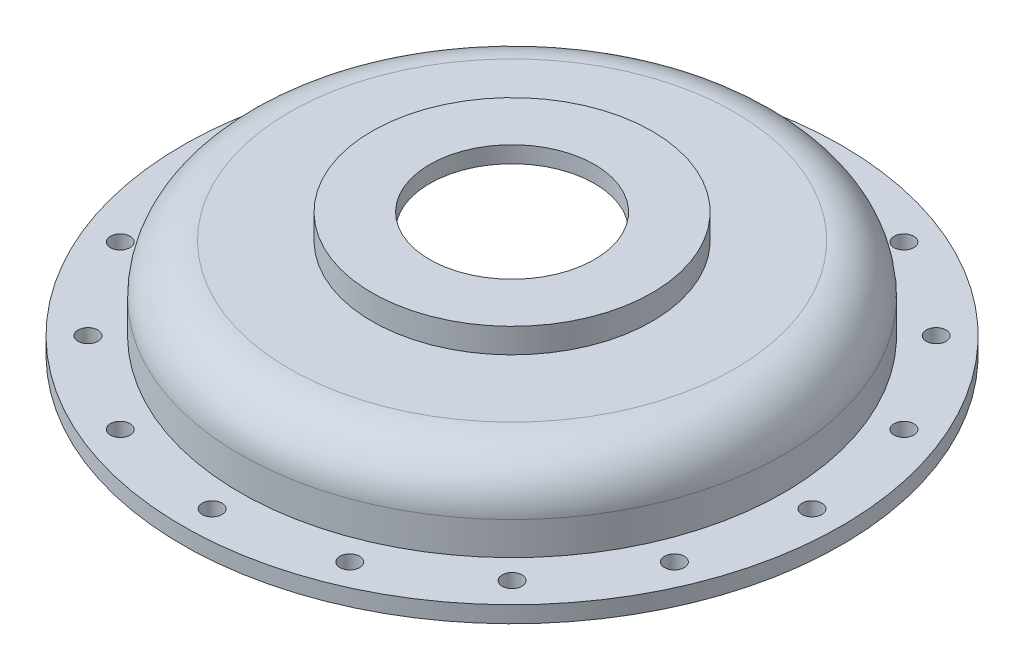
ISO-10303-21;
HEADER;
FILE_DESCRIPTION(('STEP AP214'),'2;1');
FILE_NAME('part.step','',(''),(''),'','','');
FILE_SCHEMA(('AUTOMOTIVE_DESIGN { 1 0 10303 214 1 1 1 1 }'));
ENDSEC;
DATA;
#1=APPLICATION_CONTEXT('core data for automotive mechanical design processes');
#2=APPLICATION_PROTOCOL_DEFINITION('international standard','automotive_design',2000,#1);
#3=PRODUCT_CONTEXT('',#1,'mechanical');
#4=PRODUCT('Part','Part','',(#3));
#5=PRODUCT_RELATED_PRODUCT_CATEGORY('part','',(#4));
#6=PRODUCT_DEFINITION_FORMATION('','',#4);
#7=PRODUCT_DEFINITION_CONTEXT('part definition',#1,'design');
#8=PRODUCT_DEFINITION('design','',#6,#7);
#9=PRODUCT_DEFINITION_SHAPE('','',#8);
#10=(LENGTH_UNIT() NAMED_UNIT(*) SI_UNIT(.MILLI.,.METRE.));
#11=(NAMED_UNIT(*) PLANE_ANGLE_UNIT() SI_UNIT($,.RADIAN.));
#12=(NAMED_UNIT(*) SI_UNIT($,.STERADIAN.) SOLID_ANGLE_UNIT());
#13=UNCERTAINTY_MEASURE_WITH_UNIT(LENGTH_MEASURE(1.E-05),#10,'distance_accuracy_value','');
#14=(GEOMETRIC_REPRESENTATION_CONTEXT(3) GLOBAL_UNCERTAINTY_ASSIGNED_CONTEXT((#13)) GLOBAL_UNIT_ASSIGNED_CONTEXT((#10,
#11,#12)) REPRESENTATION_CONTEXT('',''));
#15=CARTESIAN_POINT('',(0.,0.,0.));
#16=DIRECTION('',(0.,0.,1.));
#17=DIRECTION('',(1.,0.,0.));
#18=AXIS2_PLACEMENT_3D('',#15,#16,#17);
#19=CARTESIAN_POINT('',(200.,0.,0.));
#20=DIRECTION('',(0.,-1.,0.));
#21=DIRECTION('',(0.,0.,-1.));
#22=AXIS2_PLACEMENT_3D('',#19,#20,#21);
#23=PLANE('',#22);
#24=CARTESIAN_POINT('',(128.693434175951,0.,128.693434175952));
#25=DIRECTION('',(0.,1.,0.));
#26=DIRECTION('',(-0.707106781186549,0.,0.707106781186546));
#27=AXIS2_PLACEMENT_3D('',#24,#25,#26);
#28=CIRCLE('',#27,6.00000000000002);
#29=CARTESIAN_POINT('',(124.450793488832,0.,132.936074863071));
#30=VERTEX_POINT('',#29);
#31=EDGE_CURVE('E117',#30,#30,#28,.T.);
#32=ORIENTED_EDGE('',*,*,#31,.T.);
#33=EDGE_LOOP('',(#32));
#34=FACE_BOUND('',#33,.T.);
#35=CARTESIAN_POINT('',(69.6483846904459,0.,168.146074917054));
#36=DIRECTION('',(0.,1.,0.));
#37=DIRECTION('',(-0.923879532511288,0.,0.382683432365087));
#38=AXIS2_PLACEMENT_3D('',#35,#36,#37);
#39=CIRCLE('',#38,6.00000000000002);
#40=CARTESIAN_POINT('',(64.1051074953781,0.,170.442175511245));
#41=VERTEX_POINT('',#40);
#42=EDGE_CURVE('E174',#41,#41,#39,.T.);
#43=ORIENTED_EDGE('',*,*,#42,.T.);
#44=EDGE_LOOP('',(#43));
#45=FACE_BOUND('',#44,.T.);
#46=CARTESIAN_POINT('',(-6.3544960366945E-13,0.,182.));
#47=DIRECTION('',(0.,1.,0.));
#48=DIRECTION('',(-1.,0.,0.));
#49=AXIS2_PLACEMENT_3D('',#46,#47,#48);
#50=CIRCLE('',#49,6.00000000000002);
#51=CARTESIAN_POINT('',(-6.00000000000065,0.,182.));
#52=VERTEX_POINT('',#51);
#53=EDGE_CURVE('E166',#52,#52,#50,.T.);
#54=ORIENTED_EDGE('',*,*,#53,.T.);
#55=EDGE_LOOP('',(#54));
#56=FACE_BOUND('',#55,.T.);
#57=CARTESIAN_POINT('',(-69.6483846904471,0.,168.146074917054));
#58=DIRECTION('',(0.,1.,0.));
#59=DIRECTION('',(-0.923879532511285,0.,-0.382683432365094));
#60=AXIS2_PLACEMENT_3D('',#57,#58,#59);
#61=CIRCLE('',#60,6.00000000000002);
#62=CARTESIAN_POINT('',(-75.1916618855148,0.,165.849974322863));
#63=VERTEX_POINT('',#62);
#64=EDGE_CURVE('E158',#63,#63,#61,.T.);
#65=ORIENTED_EDGE('',*,*,#64,.T.);
#66=EDGE_LOOP('',(#65));
#67=FACE_BOUND('',#66,.T.);
#68=CARTESIAN_POINT('',(-128.693434175952,0.,128.693434175951));
#69=DIRECTION('',(0.,1.,0.));
#70=DIRECTION('',(-0.707106781186544,0.,-0.707106781186551));
#71=AXIS2_PLACEMENT_3D('',#68,#69,#70);
#72=CIRCLE('',#71,6.00000000000002);
#73=CARTESIAN_POINT('',(-132.936074863072,0.,124.450793488832));
#74=VERTEX_POINT('',#73);
#75=EDGE_CURVE('E150',#74,#74,#72,.T.);
#76=ORIENTED_EDGE('',*,*,#75,.T.);
#77=EDGE_LOOP('',(#76));
#78=FACE_BOUND('',#77,.T.);
#79=CARTESIAN_POINT('',(-168.146074917055,0.,69.6483846904453));
#80=DIRECTION('',(0.,1.,0.));
#81=DIRECTION('',(-0.382683432365084,0.,-0.923879532511289));
#82=AXIS2_PLACEMENT_3D('',#79,#80,#81);
#83=CIRCLE('',#82,6.00000000000002);
#84=CARTESIAN_POINT('',(-170.442175511245,0.,64.1051074953776));
#85=VERTEX_POINT('',#84);
#86=EDGE_CURVE('E142',#85,#85,#83,.T.);
#87=ORIENTED_EDGE('',*,*,#86,.T.);
#88=EDGE_LOOP('',(#87));
#89=FACE_BOUND('',#88,.T.);
#90=CARTESIAN_POINT('',(-182.,0.,0.));
#91=DIRECTION('',(0.,1.,0.));
#92=DIRECTION('',(0.,0.,-1.));
#93=AXIS2_PLACEMENT_3D('',#90,#91,#92);
#94=CIRCLE('',#93,6.00000000000002);
#95=CARTESIAN_POINT('',(-182.,0.,-6.00000000000002));
#96=VERTEX_POINT('',#95);
#97=EDGE_CURVE('E134',#96,#96,#94,.T.);
#98=ORIENTED_EDGE('',*,*,#97,.T.);
#99=EDGE_LOOP('',(#98));
#100=FACE_BOUND('',#99,.T.);
#101=CARTESIAN_POINT('',(-168.146074917054,0.,-69.6483846904477));
#102=DIRECTION('',(0.,1.,0.));
#103=DIRECTION('',(0.382683432365097,0.,-0.923879532511284));
#104=AXIS2_PLACEMENT_3D('',#101,#102,#103);
#105=CIRCLE('',#104,6.00000000000002);
#106=CARTESIAN_POINT('',(-165.849974322863,0.,-75.1916618855154));
#107=VERTEX_POINT('',#106);
#108=EDGE_CURVE('E125',#107,#107,#105,.T.);
#109=ORIENTED_EDGE('',*,*,#108,.T.);
#110=EDGE_LOOP('',(#109));
#111=FACE_BOUND('',#110,.T.);
#112=CARTESIAN_POINT('',(-128.693434175951,0.,-128.693434175953));
#113=DIRECTION('',(0.,1.,0.));
#114=DIRECTION('',(0.707106781186554,0.,-0.707106781186541));
#115=AXIS2_PLACEMENT_3D('',#112,#113,#114);
#116=CIRCLE('',#115,6.00000000000002);
#117=CARTESIAN_POINT('',(-124.450793488831,0.,-132.936074863072));
#118=VERTEX_POINT('',#117);
#119=EDGE_CURVE('E126',#118,#118,#116,.T.);
#120=ORIENTED_EDGE('',*,*,#119,.T.);
#121=EDGE_LOOP('',(#120));
#122=FACE_BOUND('',#121,.T.);
#123=CARTESIAN_POINT('',(-69.6483846904447,0.,-168.146074917055));
#124=DIRECTION('',(0.,1.,0.));
#125=DIRECTION('',(0.923879532511291,0.,-0.382683432365081));
#126=AXIS2_PLACEMENT_3D('',#123,#124,#125);
#127=CIRCLE('',#126,6.00000000000002);
#128=CARTESIAN_POINT('',(-64.1051074953769,0.,-170.442175511245));
#129=VERTEX_POINT('',#128);
#130=EDGE_CURVE('E221',#129,#129,#127,.T.);
#131=ORIENTED_EDGE('',*,*,#130,.T.);
#132=EDGE_LOOP('',(#131));
#133=FACE_BOUND('',#132,.T.);
#134=CARTESIAN_POINT('',(1.90634881100835E-12,0.,-182.));
#135=DIRECTION('',(0.,1.,0.));
#136=DIRECTION('',(1.,0.,0.));
#137=AXIS2_PLACEMENT_3D('',#134,#135,#136);
#138=CIRCLE('',#137,6.00000000000002);
#139=CARTESIAN_POINT('',(6.00000000000192,0.,-182.));
#140=VERTEX_POINT('',#139);
#141=EDGE_CURVE('E213',#140,#140,#138,.T.);
#142=ORIENTED_EDGE('',*,*,#141,.T.);
#143=EDGE_LOOP('',(#142));
#144=FACE_BOUND('',#143,.T.);
#145=CARTESIAN_POINT('',(69.6483846904482,0.,-168.146074917053));
#146=DIRECTION('',(0.,1.,0.));
#147=DIRECTION('',(0.923879532511283,0.,0.3826834323651));
#148=AXIS2_PLACEMENT_3D('',#145,#146,#147);
#149=CIRCLE('',#148,6.00000000000002);
#150=CARTESIAN_POINT('',(75.1916618855159,0.,-165.849974322863));
#151=VERTEX_POINT('',#150);
#152=EDGE_CURVE('E205',#151,#151,#149,.T.);
#153=ORIENTED_EDGE('',*,*,#152,.T.);
#154=EDGE_LOOP('',(#153));
#155=FACE_BOUND('',#154,.T.);
#156=CARTESIAN_POINT('',(128.693434175953,0.,-128.69343417595));
#157=DIRECTION('',(0.,1.,0.));
#158=DIRECTION('',(0.707106781186539,0.,0.707106781186556));
#159=AXIS2_PLACEMENT_3D('',#156,#157,#158);
#160=CIRCLE('',#159,6.00000000000002);
#161=CARTESIAN_POINT('',(132.936074863072,0.,-124.450793488831));
#162=VERTEX_POINT('',#161);
#163=EDGE_CURVE('E197',#162,#162,#160,.T.);
#164=ORIENTED_EDGE('',*,*,#163,.T.);
#165=EDGE_LOOP('',(#164));
#166=FACE_BOUND('',#165,.T.);
#167=CARTESIAN_POINT('',(168.146074917055,0.,-69.6483846904441));
#168=DIRECTION('',(0.,1.,0.));
#169=DIRECTION('',(0.382683432365077,0.,0.923879532511292));
#170=AXIS2_PLACEMENT_3D('',#167,#168,#169);
#171=CIRCLE('',#170,6.00000000000002);
#172=CARTESIAN_POINT('',(170.442175511246,0.,-64.1051074953763));
#173=VERTEX_POINT('',#172);
#174=EDGE_CURVE('E189',#173,#173,#171,.T.);
#175=ORIENTED_EDGE('',*,*,#174,.T.);
#176=EDGE_LOOP('',(#175));
#177=FACE_BOUND('',#176,.T.);
#178=CARTESIAN_POINT('',(168.146074917054,0.,69.6483846904465));
#179=DIRECTION('',(0.,1.,0.));
#180=DIRECTION('',(-0.382683432365091,0.,0.923879532511287));
#181=AXIS2_PLACEMENT_3D('',#178,#179,#180);
#182=CIRCLE('',#181,6.00000000000002);
#183=CARTESIAN_POINT('',(165.849974322864,0.,75.1916618855142));
#184=VERTEX_POINT('',#183);
#185=EDGE_CURVE('E109',#184,#184,#182,.T.);
#186=ORIENTED_EDGE('',*,*,#185,.T.);
#187=EDGE_LOOP('',(#186));
#188=FACE_BOUND('',#187,.T.);
#189=CARTESIAN_POINT('',(182.,0.,0.));
#190=DIRECTION('',(0.,1.,0.));
#191=DIRECTION('',(0.,0.,1.));
#192=AXIS2_PLACEMENT_3D('',#189,#190,#191);
#193=CIRCLE('',#192,6.00000000000002);
#194=CARTESIAN_POINT('',(182.,0.,6.00000000000002));
#195=VERTEX_POINT('',#194);
#196=EDGE_CURVE('E104',#195,#195,#193,.T.);
#197=ORIENTED_EDGE('',*,*,#196,.T.);
#198=EDGE_LOOP('',(#197));
#199=FACE_BOUND('',#198,.T.);
#200=CARTESIAN_POINT('',(0.,0.,0.));
#201=DIRECTION('',(0.,-1.,0.));
#202=DIRECTION('',(0.,0.,-1.));
#203=AXIS2_PLACEMENT_3D('',#200,#201,#202);
#204=CIRCLE('',#203,200.);
#205=CARTESIAN_POINT('',(0.,0.,-200.));
#206=VERTEX_POINT('',#205);
#207=EDGE_CURVE('E100',#206,#206,#204,.T.);
#208=ORIENTED_EDGE('',*,*,#207,.T.);
#209=EDGE_LOOP('',(#208));
#210=FACE_BOUND('',#209,.T.);
#211=CARTESIAN_POINT('',(0.,0.,0.));
#212=DIRECTION('',(0.,-1.,0.));
#213=DIRECTION('',(0.,0.,-1.));
#214=AXIS2_PLACEMENT_3D('',#211,#212,#213);
#215=CIRCLE('',#214,155.);
#216=CARTESIAN_POINT('',(0.,0.,-155.));
#217=VERTEX_POINT('',#216);
#218=EDGE_CURVE('E10',#217,#217,#215,.T.);
#219=ORIENTED_EDGE('',*,*,#218,.F.);
#220=EDGE_LOOP('',(#219));
#221=FACE_BOUND('',#220,.T.);
#222=ADVANCED_FACE('F41',(#34,#45,#56,#67,#78,#89,#100,#111,#122,#133,#144,#155,#166,#177,#188,
#199,#210,#221),#23,.T.);
#223=CARTESIAN_POINT('',(0.,0.,0.));
#224=DIRECTION('',(0.,-1.,0.));
#225=DIRECTION('',(0.,0.,-1.));
#226=AXIS2_PLACEMENT_3D('',#223,#224,#225);
#227=CYLINDRICAL_SURFACE('',#226,155.);
#228=ORIENTED_EDGE('',*,*,#218,.T.);
#229=EDGE_LOOP('',(#228));
#230=FACE_BOUND('',#229,.T.);
#231=CARTESIAN_POINT('',(0.,30.,0.));
#232=DIRECTION('',(0.,-1.,0.));
#233=DIRECTION('',(0.,0.,-1.));
#234=AXIS2_PLACEMENT_3D('',#231,#232,#233);
#235=CIRCLE('',#234,155.);
#236=CARTESIAN_POINT('',(0.,30.,-155.));
#237=VERTEX_POINT('',#236);
#238=EDGE_CURVE('E48',#237,#237,#235,.T.);
#239=ORIENTED_EDGE('',*,*,#238,.F.);
#240=EDGE_LOOP('',(#239));
#241=FACE_BOUND('',#240,.T.);
#242=ADVANCED_FACE('F276',(#230,#241),#227,.F.);
#243=CARTESIAN_POINT('',(0.,30.,0.));
#244=DIRECTION('',(0.,-1.,0.));
#245=DIRECTION('',(0.,0.,-1.));
#246=AXIS2_PLACEMENT_3D('',#243,#244,#245);
#247=TOROIDAL_SURFACE('',#246,135.,20.);
#248=ORIENTED_EDGE('',*,*,#238,.T.);
#249=EDGE_LOOP('',(#248));
#250=FACE_BOUND('',#249,.T.);
#251=CARTESIAN_POINT('',(0.,50.,0.));
#252=DIRECTION('',(0.,-1.,0.));
#253=DIRECTION('',(0.,0.,-1.));
#254=AXIS2_PLACEMENT_3D('',#251,#252,#253);
#255=CIRCLE('',#254,135.);
#256=CARTESIAN_POINT('',(0.,50.,-135.));
#257=VERTEX_POINT('',#256);
#258=EDGE_CURVE('E53',#257,#257,#255,.T.);
#259=ORIENTED_EDGE('',*,*,#258,.F.);
#260=EDGE_LOOP('',(#259));
#261=FACE_BOUND('',#260,.T.);
#262=ADVANCED_FACE('F281',(#250,#261),#247,.F.);
#263=CARTESIAN_POINT('',(75.,50.,0.));
#264=DIRECTION('',(0.,-1.,0.));
#265=DIRECTION('',(0.,0.,-1.));
#266=AXIS2_PLACEMENT_3D('',#263,#264,#265);
#267=PLANE('',#266);
#268=ORIENTED_EDGE('',*,*,#258,.T.);
#269=EDGE_LOOP('',(#268));
#270=FACE_BOUND('',#269,.T.);
#271=CARTESIAN_POINT('',(0.,50.,0.));
#272=DIRECTION('',(0.,-1.,0.));
#273=DIRECTION('',(0.,0.,-1.));
#274=AXIS2_PLACEMENT_3D('',#271,#272,#273);
#275=CIRCLE('',#274,75.);
#276=CARTESIAN_POINT('',(0.,50.,-75.));
#277=VERTEX_POINT('',#276);
#278=EDGE_CURVE('E58',#277,#277,#275,.T.);
#279=ORIENTED_EDGE('',*,*,#278,.F.);
#280=EDGE_LOOP('',(#279));
#281=FACE_BOUND('',#280,.T.);
#282=ADVANCED_FACE('F350',(#270,#281),#267,.T.);
#283=CARTESIAN_POINT('',(0.,0.,0.));
#284=DIRECTION('',(0.,-1.,0.));
#285=DIRECTION('',(0.,0.,-1.));
#286=AXIS2_PLACEMENT_3D('',#283,#284,#285);
#287=CYLINDRICAL_SURFACE('',#286,75.);
#288=ORIENTED_EDGE('',*,*,#278,.T.);
#289=EDGE_LOOP('',(#288));
#290=FACE_BOUND('',#289,.T.);
#291=CARTESIAN_POINT('',(0.,65.,0.));
#292=DIRECTION('',(0.,-1.,0.));
#293=DIRECTION('',(0.,0.,-1.));
#294=AXIS2_PLACEMENT_3D('',#291,#292,#293);
#295=CIRCLE('',#294,75.);
#296=CARTESIAN_POINT('',(0.,65.,-75.));
#297=VERTEX_POINT('',#296);
#298=EDGE_CURVE('E64',#297,#297,#295,.T.);
#299=ORIENTED_EDGE('',*,*,#298,.F.);
#300=EDGE_LOOP('',(#299));
#301=FACE_BOUND('',#300,.T.);
#302=ADVANCED_FACE('F346',(#290,#301),#287,.F.);
#303=CARTESIAN_POINT('',(75.,65.,0.));
#304=DIRECTION('',(0.,-1.,0.));
#305=DIRECTION('',(0.,0.,-1.));
#306=AXIS2_PLACEMENT_3D('',#303,#304,#305);
#307=PLANE('',#306);
#308=ORIENTED_EDGE('',*,*,#298,.T.);
#309=EDGE_LOOP('',(#308));
#310=FACE_BOUND('',#309,.T.);
#311=CARTESIAN_POINT('',(0.,65.,0.));
#312=DIRECTION('',(0.,-1.,0.));
#313=DIRECTION('',(0.,0.,-1.));
#314=AXIS2_PLACEMENT_3D('',#311,#312,#313);
#315=CIRCLE('',#314,50.);
#316=CARTESIAN_POINT('',(0.,65.,-50.));
#317=VERTEX_POINT('',#316);
#318=EDGE_CURVE('E68',#317,#317,#315,.T.);
#319=ORIENTED_EDGE('',*,*,#318,.F.);
#320=EDGE_LOOP('',(#319));
#321=FACE_BOUND('',#320,.T.);
#322=ADVANCED_FACE('F342',(#310,#321),#307,.T.);
#323=CARTESIAN_POINT('',(0.,0.,0.));
#324=DIRECTION('',(0.,-1.,0.));
#325=DIRECTION('',(0.,0.,-1.));
#326=AXIS2_PLACEMENT_3D('',#323,#324,#325);
#327=CYLINDRICAL_SURFACE('',#326,50.);
#328=ORIENTED_EDGE('',*,*,#318,.T.);
#329=EDGE_LOOP('',(#328));
#330=FACE_BOUND('',#329,.T.);
#331=CARTESIAN_POINT('',(0.,75.,0.));
#332=DIRECTION('',(0.,-1.,0.));
#333=DIRECTION('',(0.,0.,-1.));
#334=AXIS2_PLACEMENT_3D('',#331,#332,#333);
#335=CIRCLE('',#334,50.);
#336=CARTESIAN_POINT('',(0.,75.,-50.));
#337=VERTEX_POINT('',#336);
#338=EDGE_CURVE('E72',#337,#337,#335,.T.);
#339=ORIENTED_EDGE('',*,*,#338,.F.);
#340=EDGE_LOOP('',(#339));
#341=FACE_BOUND('',#340,.T.);
#342=ADVANCED_FACE('F338',(#330,#341),#327,.F.);
#343=CARTESIAN_POINT('',(50.,75.,0.));
#344=DIRECTION('',(0.,1.,0.));
#345=DIRECTION('',(0.,0.,1.));
#346=AXIS2_PLACEMENT_3D('',#343,#344,#345);
#347=PLANE('',#346);
#348=ORIENTED_EDGE('',*,*,#338,.T.);
#349=EDGE_LOOP('',(#348));
#350=FACE_BOUND('',#349,.T.);
#351=CARTESIAN_POINT('',(0.,75.,0.));
#352=DIRECTION('',(0.,-1.,0.));
#353=DIRECTION('',(0.,0.,-1.));
#354=AXIS2_PLACEMENT_3D('',#351,#352,#353);
#355=CIRCLE('',#354,85.);
#356=CARTESIAN_POINT('',(0.,75.,-85.));
#357=VERTEX_POINT('',#356);
#358=EDGE_CURVE('E76',#357,#357,#355,.T.);
#359=ORIENTED_EDGE('',*,*,#358,.F.);
#360=EDGE_LOOP('',(#359));
#361=FACE_BOUND('',#360,.T.);
#362=ADVANCED_FACE('F334',(#350,#361),#347,.T.);
#363=CARTESIAN_POINT('',(0.,0.,0.));
#364=DIRECTION('',(0.,-1.,0.));
#365=DIRECTION('',(0.,0.,-1.));
#366=AXIS2_PLACEMENT_3D('',#363,#364,#365);
#367=CYLINDRICAL_SURFACE('',#366,85.);
#368=ORIENTED_EDGE('',*,*,#358,.T.);
#369=EDGE_LOOP('',(#368));
#370=FACE_BOUND('',#369,.T.);
#371=CARTESIAN_POINT('',(0.,60.,0.));
#372=DIRECTION('',(0.,-1.,0.));
#373=DIRECTION('',(0.,0.,-1.));
#374=AXIS2_PLACEMENT_3D('',#371,#372,#373);
#375=CIRCLE('',#374,85.);
#376=CARTESIAN_POINT('',(0.,60.,-85.));
#377=VERTEX_POINT('',#376);
#378=EDGE_CURVE('E80',#377,#377,#375,.T.);
#379=ORIENTED_EDGE('',*,*,#378,.F.);
#380=EDGE_LOOP('',(#379));
#381=FACE_BOUND('',#380,.T.);
#382=ADVANCED_FACE('F330',(#370,#381),#367,.T.);
#383=CARTESIAN_POINT('',(85.,60.,0.));
#384=DIRECTION('',(0.,1.,0.));
#385=DIRECTION('',(0.,0.,1.));
#386=AXIS2_PLACEMENT_3D('',#383,#384,#385);
#387=PLANE('',#386);
#388=ORIENTED_EDGE('',*,*,#378,.T.);
#389=EDGE_LOOP('',(#388));
#390=FACE_BOUND('',#389,.T.);
#391=CARTESIAN_POINT('',(0.,60.,0.));
#392=DIRECTION('',(0.,-1.,0.));
#393=DIRECTION('',(0.,0.,-1.));
#394=AXIS2_PLACEMENT_3D('',#391,#392,#393);
#395=CIRCLE('',#394,135.);
#396=CARTESIAN_POINT('',(0.,60.,-135.));
#397=VERTEX_POINT('',#396);
#398=EDGE_CURVE('E84',#397,#397,#395,.T.);
#399=ORIENTED_EDGE('',*,*,#398,.F.);
#400=EDGE_LOOP('',(#399));
#401=FACE_BOUND('',#400,.T.);
#402=ADVANCED_FACE('F326',(#390,#401),#387,.T.);
#403=CARTESIAN_POINT('',(0.,30.,0.));
#404=DIRECTION('',(0.,-1.,0.));
#405=DIRECTION('',(0.,0.,-1.));
#406=AXIS2_PLACEMENT_3D('',#403,#404,#405);
#407=TOROIDAL_SURFACE('',#406,135.,30.);
#408=ORIENTED_EDGE('',*,*,#398,.T.);
#409=EDGE_LOOP('',(#408));
#410=FACE_BOUND('',#409,.T.);
#411=CARTESIAN_POINT('',(0.,30.,0.));
#412=DIRECTION('',(0.,-1.,0.));
#413=DIRECTION('',(0.,0.,-1.));
#414=AXIS2_PLACEMENT_3D('',#411,#412,#413);
#415=CIRCLE('',#414,165.);
#416=CARTESIAN_POINT('',(0.,30.,-165.));
#417=VERTEX_POINT('',#416);
#418=EDGE_CURVE('E88',#417,#417,#415,.T.);
#419=ORIENTED_EDGE('',*,*,#418,.F.);
#420=EDGE_LOOP('',(#419));
#421=FACE_BOUND('',#420,.T.);
#422=ADVANCED_FACE('F322',(#410,#421),#407,.T.);
#423=CARTESIAN_POINT('',(0.,0.,0.));
#424=DIRECTION('',(0.,-1.,0.));
#425=DIRECTION('',(0.,0.,-1.));
#426=AXIS2_PLACEMENT_3D('',#423,#424,#425);
#427=CYLINDRICAL_SURFACE('',#426,165.);
#428=ORIENTED_EDGE('',*,*,#418,.T.);
#429=EDGE_LOOP('',(#428));
#430=FACE_BOUND('',#429,.T.);
#431=CARTESIAN_POINT('',(0.,10.,0.));
#432=DIRECTION('',(0.,-1.,0.));
#433=DIRECTION('',(0.,0.,-1.));
#434=AXIS2_PLACEMENT_3D('',#431,#432,#433);
#435=CIRCLE('',#434,165.);
#436=CARTESIAN_POINT('',(0.,10.,-165.));
#437=VERTEX_POINT('',#436);
#438=EDGE_CURVE('E92',#437,#437,#435,.T.);
#439=ORIENTED_EDGE('',*,*,#438,.F.);
#440=EDGE_LOOP('',(#439));
#441=FACE_BOUND('',#440,.T.);
#442=ADVANCED_FACE('F247',(#430,#441),#427,.T.);
#443=CARTESIAN_POINT('',(200.,10.,0.));
#444=DIRECTION('',(0.,1.,0.));
#445=DIRECTION('',(0.,0.,1.));
#446=AXIS2_PLACEMENT_3D('',#443,#444,#445);
#447=PLANE('',#446);
#448=CARTESIAN_POINT('',(128.693434175951,10.,128.693434175952));
#449=DIRECTION('',(0.,1.,0.));
#450=DIRECTION('',(-0.707106781186549,0.,0.707106781186546));
#451=AXIS2_PLACEMENT_3D('',#448,#449,#450);
#452=CIRCLE('',#451,6.00000000000002);
#453=CARTESIAN_POINT('',(124.450793488832,10.,132.936074863071));
#454=VERTEX_POINT('',#453);
#455=EDGE_CURVE('E178',#454,#454,#452,.T.);
#456=ORIENTED_EDGE('',*,*,#455,.F.);
#457=EDGE_LOOP('',(#456));
#458=FACE_BOUND('',#457,.T.);
#459=CARTESIAN_POINT('',(69.6483846904459,10.,168.146074917054));
#460=DIRECTION('',(0.,1.,0.));
#461=DIRECTION('',(-0.923879532511288,0.,0.382683432365087));
#462=AXIS2_PLACEMENT_3D('',#459,#460,#461);
#463=CIRCLE('',#462,6.00000000000002);
#464=CARTESIAN_POINT('',(64.1051074953781,10.,170.442175511245));
#465=VERTEX_POINT('',#464);
#466=EDGE_CURVE('E170',#465,#465,#463,.T.);
#467=ORIENTED_EDGE('',*,*,#466,.F.);
#468=EDGE_LOOP('',(#467));
#469=FACE_BOUND('',#468,.T.);
#470=CARTESIAN_POINT('',(-6.3544960366945E-13,10.,182.));
#471=DIRECTION('',(0.,1.,0.));
#472=DIRECTION('',(-1.,0.,0.));
#473=AXIS2_PLACEMENT_3D('',#470,#471,#472);
#474=CIRCLE('',#473,6.00000000000002);
#475=CARTESIAN_POINT('',(-6.00000000000065,10.,182.));
#476=VERTEX_POINT('',#475);
#477=EDGE_CURVE('E162',#476,#476,#474,.T.);
#478=ORIENTED_EDGE('',*,*,#477,.F.);
#479=EDGE_LOOP('',(#478));
#480=FACE_BOUND('',#479,.T.);
#481=CARTESIAN_POINT('',(-69.6483846904471,10.,168.146074917054));
#482=DIRECTION('',(0.,1.,0.));
#483=DIRECTION('',(-0.923879532511285,0.,-0.382683432365094));
#484=AXIS2_PLACEMENT_3D('',#481,#482,#483);
#485=CIRCLE('',#484,6.00000000000002);
#486=CARTESIAN_POINT('',(-75.1916618855148,10.,165.849974322863));
#487=VERTEX_POINT('',#486);
#488=EDGE_CURVE('E154',#487,#487,#485,.T.);
#489=ORIENTED_EDGE('',*,*,#488,.F.);
#490=EDGE_LOOP('',(#489));
#491=FACE_BOUND('',#490,.T.);
#492=CARTESIAN_POINT('',(-128.693434175952,10.,128.693434175951));
#493=DIRECTION('',(0.,1.,0.));
#494=DIRECTION('',(-0.707106781186544,0.,-0.707106781186551));
#495=AXIS2_PLACEMENT_3D('',#492,#493,#494);
#496=CIRCLE('',#495,6.00000000000002);
#497=CARTESIAN_POINT('',(-132.936074863072,10.,124.450793488832));
#498=VERTEX_POINT('',#497);
#499=EDGE_CURVE('E146',#498,#498,#496,.T.);
#500=ORIENTED_EDGE('',*,*,#499,.F.);
#501=EDGE_LOOP('',(#500));
#502=FACE_BOUND('',#501,.T.);
#503=CARTESIAN_POINT('',(-168.146074917055,10.,69.6483846904453));
#504=DIRECTION('',(0.,1.,0.));
#505=DIRECTION('',(-0.382683432365084,0.,-0.923879532511289));
#506=AXIS2_PLACEMENT_3D('',#503,#504,#505);
#507=CIRCLE('',#506,6.00000000000002);
#508=CARTESIAN_POINT('',(-170.442175511245,10.,64.1051074953776));
#509=VERTEX_POINT('',#508);
#510=EDGE_CURVE('E138',#509,#509,#507,.T.);
#511=ORIENTED_EDGE('',*,*,#510,.F.);
#512=EDGE_LOOP('',(#511));
#513=FACE_BOUND('',#512,.T.);
#514=CARTESIAN_POINT('',(-182.,10.,0.));
#515=DIRECTION('',(0.,1.,0.));
#516=DIRECTION('',(0.,0.,-1.));
#517=AXIS2_PLACEMENT_3D('',#514,#515,#516);
#518=CIRCLE('',#517,6.00000000000002);
#519=CARTESIAN_POINT('',(-182.,10.,-6.00000000000002));
#520=VERTEX_POINT('',#519);
#521=EDGE_CURVE('E130',#520,#520,#518,.T.);
#522=ORIENTED_EDGE('',*,*,#521,.F.);
#523=EDGE_LOOP('',(#522));
#524=FACE_BOUND('',#523,.T.);
#525=CARTESIAN_POINT('',(-168.146074917054,10.,-69.6483846904477));
#526=DIRECTION('',(0.,1.,0.));
#527=DIRECTION('',(0.382683432365097,0.,-0.923879532511284));
#528=AXIS2_PLACEMENT_3D('',#525,#526,#527);
#529=CIRCLE('',#528,6.00000000000002);
#530=CARTESIAN_POINT('',(-165.849974322863,10.,-75.1916618855154));
#531=VERTEX_POINT('',#530);
#532=EDGE_CURVE('E121',#531,#531,#529,.T.);
#533=ORIENTED_EDGE('',*,*,#532,.F.);
#534=EDGE_LOOP('',(#533));
#535=FACE_BOUND('',#534,.T.);
#536=CARTESIAN_POINT('',(-128.693434175951,10.,-128.693434175953));
#537=DIRECTION('',(0.,1.,0.));
#538=DIRECTION('',(0.707106781186554,0.,-0.707106781186541));
#539=AXIS2_PLACEMENT_3D('',#536,#537,#538);
#540=CIRCLE('',#539,6.00000000000002);
#541=CARTESIAN_POINT('',(-124.450793488831,10.,-132.936074863072));
#542=VERTEX_POINT('',#541);
#543=EDGE_CURVE('E225',#542,#542,#540,.T.);
#544=ORIENTED_EDGE('',*,*,#543,.F.);
#545=EDGE_LOOP('',(#544));
#546=FACE_BOUND('',#545,.T.);
#547=CARTESIAN_POINT('',(-69.6483846904447,10.,-168.146074917055));
#548=DIRECTION('',(0.,1.,0.));
#549=DIRECTION('',(0.923879532511291,0.,-0.382683432365081));
#550=AXIS2_PLACEMENT_3D('',#547,#548,#549);
#551=CIRCLE('',#550,6.00000000000002);
#552=CARTESIAN_POINT('',(-64.1051074953769,10.,-170.442175511245));
#553=VERTEX_POINT('',#552);
#554=EDGE_CURVE('E217',#553,#553,#551,.T.);
#555=ORIENTED_EDGE('',*,*,#554,.F.);
#556=EDGE_LOOP('',(#555));
#557=FACE_BOUND('',#556,.T.);
#558=CARTESIAN_POINT('',(1.90634881100835E-12,10.,-182.));
#559=DIRECTION('',(0.,1.,0.));
#560=DIRECTION('',(1.,0.,0.));
#561=AXIS2_PLACEMENT_3D('',#558,#559,#560);
#562=CIRCLE('',#561,6.00000000000002);
#563=CARTESIAN_POINT('',(6.00000000000192,10.,-182.));
#564=VERTEX_POINT('',#563);
#565=EDGE_CURVE('E209',#564,#564,#562,.T.);
#566=ORIENTED_EDGE('',*,*,#565,.F.);
#567=EDGE_LOOP('',(#566));
#568=FACE_BOUND('',#567,.T.);
#569=CARTESIAN_POINT('',(69.6483846904482,10.,-168.146074917053));
#570=DIRECTION('',(0.,1.,0.));
#571=DIRECTION('',(0.923879532511283,0.,0.3826834323651));
#572=AXIS2_PLACEMENT_3D('',#569,#570,#571);
#573=CIRCLE('',#572,6.00000000000002);
#574=CARTESIAN_POINT('',(75.1916618855159,10.,-165.849974322863));
#575=VERTEX_POINT('',#574);
#576=EDGE_CURVE('E201',#575,#575,#573,.T.);
#577=ORIENTED_EDGE('',*,*,#576,.F.);
#578=EDGE_LOOP('',(#577));
#579=FACE_BOUND('',#578,.T.);
#580=CARTESIAN_POINT('',(128.693434175953,10.,-128.69343417595));
#581=DIRECTION('',(0.,1.,0.));
#582=DIRECTION('',(0.707106781186539,0.,0.707106781186556));
#583=AXIS2_PLACEMENT_3D('',#580,#581,#582);
#584=CIRCLE('',#583,6.00000000000002);
#585=CARTESIAN_POINT('',(132.936074863072,10.,-124.450793488831));
#586=VERTEX_POINT('',#585);
#587=EDGE_CURVE('E193',#586,#586,#584,.T.);
#588=ORIENTED_EDGE('',*,*,#587,.F.);
#589=EDGE_LOOP('',(#588));
#590=FACE_BOUND('',#589,.T.);
#591=CARTESIAN_POINT('',(168.146074917055,10.,-69.6483846904441));
#592=DIRECTION('',(0.,1.,0.));
#593=DIRECTION('',(0.382683432365077,0.,0.923879532511292));
#594=AXIS2_PLACEMENT_3D('',#591,#592,#593);
#595=CIRCLE('',#594,6.00000000000002);
#596=CARTESIAN_POINT('',(170.442175511246,10.,-64.1051074953763));
#597=VERTEX_POINT('',#596);
#598=EDGE_CURVE('E185',#597,#597,#595,.T.);
#599=ORIENTED_EDGE('',*,*,#598,.F.);
#600=EDGE_LOOP('',(#599));
#601=FACE_BOUND('',#600,.T.);
#602=CARTESIAN_POINT('',(168.146074917054,10.,69.6483846904465));
#603=DIRECTION('',(0.,1.,0.));
#604=DIRECTION('',(-0.382683432365091,0.,0.923879532511287));
#605=AXIS2_PLACEMENT_3D('',#602,#603,#604);
#606=CIRCLE('',#605,6.00000000000002);
#607=CARTESIAN_POINT('',(165.849974322864,10.,75.1916618855142));
#608=VERTEX_POINT('',#607);
#609=EDGE_CURVE('E113',#608,#608,#606,.T.);
#610=ORIENTED_EDGE('',*,*,#609,.F.);
#611=EDGE_LOOP('',(#610));
#612=FACE_BOUND('',#611,.T.);
#613=CARTESIAN_POINT('',(182.,10.,0.));
#614=DIRECTION('',(0.,1.,0.));
#615=DIRECTION('',(0.,0.,1.));
#616=AXIS2_PLACEMENT_3D('',#613,#614,#615);
#617=CIRCLE('',#616,6.00000000000002);
#618=CARTESIAN_POINT('',(182.,10.,6.00000000000002));
#619=VERTEX_POINT('',#618);
#620=EDGE_CURVE('E105',#619,#619,#617,.T.);
#621=ORIENTED_EDGE('',*,*,#620,.F.);
#622=EDGE_LOOP('',(#621));
#623=FACE_BOUND('',#622,.T.);
#624=ORIENTED_EDGE('',*,*,#438,.T.);
#625=EDGE_LOOP('',(#624));
#626=FACE_BOUND('',#625,.T.);
#627=CARTESIAN_POINT('',(0.,10.,0.));
#628=DIRECTION('',(0.,-1.,0.));
#629=DIRECTION('',(0.,0.,-1.));
#630=AXIS2_PLACEMENT_3D('',#627,#628,#629);
#631=CIRCLE('',#630,200.);
#632=CARTESIAN_POINT('',(0.,10.,-200.));
#633=VERTEX_POINT('',#632);
#634=EDGE_CURVE('E96',#633,#633,#631,.T.);
#635=ORIENTED_EDGE('',*,*,#634,.F.);
#636=EDGE_LOOP('',(#635));
#637=FACE_BOUND('',#636,.T.);
#638=ADVANCED_FACE('F243',(#458,#469,#480,#491,#502,#513,#524,#535,#546,#557,#568,#579,#590,
#601,#612,#623,#626,#637),#447,.T.);
#639=CARTESIAN_POINT('',(0.,0.,0.));
#640=DIRECTION('',(0.,-1.,0.));
#641=DIRECTION('',(0.,0.,-1.));
#642=AXIS2_PLACEMENT_3D('',#639,#640,#641);
#643=CYLINDRICAL_SURFACE('',#642,200.);
#644=ORIENTED_EDGE('',*,*,#634,.T.);
#645=EDGE_LOOP('',(#644));
#646=FACE_BOUND('',#645,.T.);
#647=ORIENTED_EDGE('',*,*,#207,.F.);
#648=EDGE_LOOP('',(#647));
#649=FACE_BOUND('',#648,.T.);
#650=ADVANCED_FACE('F246',(#646,#649),#643,.T.);
#651=CARTESIAN_POINT('',(182.,0.,0.));
#652=DIRECTION('',(0.,1.,0.));
#653=DIRECTION('',(0.,0.,1.));
#654=AXIS2_PLACEMENT_3D('',#651,#652,#653);
#655=CYLINDRICAL_SURFACE('',#654,6.00000000000002);
#656=ORIENTED_EDGE('',*,*,#196,.F.);
#657=EDGE_LOOP('',(#656));
#658=FACE_BOUND('',#657,.T.);
#659=ORIENTED_EDGE('',*,*,#620,.T.);
#660=EDGE_LOOP('',(#659));
#661=FACE_BOUND('',#660,.T.);
#662=ADVANCED_FACE('F270',(#658,#661),#655,.F.);
#663=CARTESIAN_POINT('',(168.146074917054,0.,69.6483846904465));
#664=DIRECTION('',(0.,1.,0.));
#665=DIRECTION('',(0.,0.,1.));
#666=AXIS2_PLACEMENT_3D('',#663,#664,#665);
#667=CYLINDRICAL_SURFACE('',#666,6.00000000000002);
#668=ORIENTED_EDGE('',*,*,#185,.F.);
#669=EDGE_LOOP('',(#668));
#670=FACE_BOUND('',#669,.T.);
#671=ORIENTED_EDGE('',*,*,#609,.T.);
#672=EDGE_LOOP('',(#671));
#673=FACE_BOUND('',#672,.T.);
#674=ADVANCED_FACE('F312',(#670,#673),#667,.F.);
#675=CARTESIAN_POINT('',(168.146074917055,0.,-69.6483846904441));
#676=DIRECTION('',(0.,1.,0.));
#677=DIRECTION('',(0.,0.,1.));
#678=AXIS2_PLACEMENT_3D('',#675,#676,#677);
#679=CYLINDRICAL_SURFACE('',#678,6.00000000000002);
#680=ORIENTED_EDGE('',*,*,#174,.F.);
#681=EDGE_LOOP('',(#680));
#682=FACE_BOUND('',#681,.T.);
#683=ORIENTED_EDGE('',*,*,#598,.T.);
#684=EDGE_LOOP('',(#683));
#685=FACE_BOUND('',#684,.T.);
#686=ADVANCED_FACE('F315',(#682,#685),#679,.F.);
#687=CARTESIAN_POINT('',(128.693434175953,0.,-128.69343417595));
#688=DIRECTION('',(0.,1.,0.));
#689=DIRECTION('',(0.,0.,1.));
#690=AXIS2_PLACEMENT_3D('',#687,#688,#689);
#691=CYLINDRICAL_SURFACE('',#690,6.00000000000002);
#692=ORIENTED_EDGE('',*,*,#163,.F.);
#693=EDGE_LOOP('',(#692));
#694=FACE_BOUND('',#693,.T.);
#695=ORIENTED_EDGE('',*,*,#587,.T.);
#696=EDGE_LOOP('',(#695));
#697=FACE_BOUND('',#696,.T.);
#698=ADVANCED_FACE('F437',(#694,#697),#691,.F.);
#699=CARTESIAN_POINT('',(69.6483846904482,0.,-168.146074917053));
#700=DIRECTION('',(0.,1.,0.));
#701=DIRECTION('',(0.,0.,1.));
#702=AXIS2_PLACEMENT_3D('',#699,#700,#701);
#703=CYLINDRICAL_SURFACE('',#702,6.00000000000002);
#704=ORIENTED_EDGE('',*,*,#152,.F.);
#705=EDGE_LOOP('',(#704));
#706=FACE_BOUND('',#705,.T.);
#707=ORIENTED_EDGE('',*,*,#576,.T.);
#708=EDGE_LOOP('',(#707));
#709=FACE_BOUND('',#708,.T.);
#710=ADVANCED_FACE('F445',(#706,#709),#703,.F.);
#711=CARTESIAN_POINT('',(1.90634881100835E-12,0.,-182.));
#712=DIRECTION('',(0.,1.,0.));
#713=DIRECTION('',(0.,0.,1.));
#714=AXIS2_PLACEMENT_3D('',#711,#712,#713);
#715=CYLINDRICAL_SURFACE('',#714,6.00000000000002);
#716=ORIENTED_EDGE('',*,*,#141,.F.);
#717=EDGE_LOOP('',(#716));
#718=FACE_BOUND('',#717,.T.);
#719=ORIENTED_EDGE('',*,*,#565,.T.);
#720=EDGE_LOOP('',(#719));
#721=FACE_BOUND('',#720,.T.);
#722=ADVANCED_FACE('F453',(#718,#721),#715,.F.);
#723=CARTESIAN_POINT('',(-69.6483846904447,0.,-168.146074917055));
#724=DIRECTION('',(0.,1.,0.));
#725=DIRECTION('',(0.,0.,1.));
#726=AXIS2_PLACEMENT_3D('',#723,#724,#725);
#727=CYLINDRICAL_SURFACE('',#726,6.00000000000002);
#728=ORIENTED_EDGE('',*,*,#130,.F.);
#729=EDGE_LOOP('',(#728));
#730=FACE_BOUND('',#729,.T.);
#731=ORIENTED_EDGE('',*,*,#554,.T.);
#732=EDGE_LOOP('',(#731));
#733=FACE_BOUND('',#732,.T.);
#734=ADVANCED_FACE('F239',(#730,#733),#727,.F.);
#735=CARTESIAN_POINT('',(-128.693434175951,0.,-128.693434175953));
#736=DIRECTION('',(0.,1.,0.));
#737=DIRECTION('',(0.,0.,1.));
#738=AXIS2_PLACEMENT_3D('',#735,#736,#737);
#739=CYLINDRICAL_SURFACE('',#738,6.00000000000002);
#740=ORIENTED_EDGE('',*,*,#119,.F.);
#741=EDGE_LOOP('',(#740));
#742=FACE_BOUND('',#741,.T.);
#743=ORIENTED_EDGE('',*,*,#543,.T.);
#744=EDGE_LOOP('',(#743));
#745=FACE_BOUND('',#744,.T.);
#746=ADVANCED_FACE('F235',(#742,#745),#739,.F.);
#747=CARTESIAN_POINT('',(-168.146074917054,0.,-69.6483846904477));
#748=DIRECTION('',(0.,1.,0.));
#749=DIRECTION('',(0.,0.,1.));
#750=AXIS2_PLACEMENT_3D('',#747,#748,#749);
#751=CYLINDRICAL_SURFACE('',#750,6.00000000000002);
#752=ORIENTED_EDGE('',*,*,#108,.F.);
#753=EDGE_LOOP('',(#752));
#754=FACE_BOUND('',#753,.T.);
#755=ORIENTED_EDGE('',*,*,#532,.T.);
#756=EDGE_LOOP('',(#755));
#757=FACE_BOUND('',#756,.T.);
#758=ADVANCED_FACE('F238',(#754,#757),#751,.F.);
#759=CARTESIAN_POINT('',(-182.,0.,0.));
#760=DIRECTION('',(0.,1.,0.));
#761=DIRECTION('',(0.,0.,1.));
#762=AXIS2_PLACEMENT_3D('',#759,#760,#761);
#763=CYLINDRICAL_SURFACE('',#762,6.00000000000002);
#764=ORIENTED_EDGE('',*,*,#97,.F.);
#765=EDGE_LOOP('',(#764));
#766=FACE_BOUND('',#765,.T.);
#767=ORIENTED_EDGE('',*,*,#521,.T.);
#768=EDGE_LOOP('',(#767));
#769=FACE_BOUND('',#768,.T.);
#770=ADVANCED_FACE('F300',(#766,#769),#763,.F.);
#771=CARTESIAN_POINT('',(-168.146074917055,0.,69.6483846904453));
#772=DIRECTION('',(0.,1.,0.));
#773=DIRECTION('',(0.,0.,1.));
#774=AXIS2_PLACEMENT_3D('',#771,#772,#773);
#775=CYLINDRICAL_SURFACE('',#774,6.00000000000002);
#776=ORIENTED_EDGE('',*,*,#86,.F.);
#777=EDGE_LOOP('',(#776));
#778=FACE_BOUND('',#777,.T.);
#779=ORIENTED_EDGE('',*,*,#510,.T.);
#780=EDGE_LOOP('',(#779));
#781=FACE_BOUND('',#780,.T.);
#782=ADVANCED_FACE('F307',(#778,#781),#775,.F.);
#783=CARTESIAN_POINT('',(-128.693434175952,0.,128.693434175951));
#784=DIRECTION('',(0.,1.,0.));
#785=DIRECTION('',(0.,0.,1.));
#786=AXIS2_PLACEMENT_3D('',#783,#784,#785);
#787=CYLINDRICAL_SURFACE('',#786,6.00000000000002);
#788=ORIENTED_EDGE('',*,*,#75,.F.);
#789=EDGE_LOOP('',(#788));
#790=FACE_BOUND('',#789,.T.);
#791=ORIENTED_EDGE('',*,*,#499,.T.);
#792=EDGE_LOOP('',(#791));
#793=FACE_BOUND('',#792,.T.);
#794=ADVANCED_FACE('F495',(#790,#793),#787,.F.);
#795=CARTESIAN_POINT('',(-69.6483846904471,0.,168.146074917054));
#796=DIRECTION('',(0.,1.,0.));
#797=DIRECTION('',(0.,0.,1.));
#798=AXIS2_PLACEMENT_3D('',#795,#796,#797);
#799=CYLINDRICAL_SURFACE('',#798,6.00000000000002);
#800=ORIENTED_EDGE('',*,*,#64,.F.);
#801=EDGE_LOOP('',(#800));
#802=FACE_BOUND('',#801,.T.);
#803=ORIENTED_EDGE('',*,*,#488,.T.);
#804=EDGE_LOOP('',(#803));
#805=FACE_BOUND('',#804,.T.);
#806=ADVANCED_FACE('F505',(#802,#805),#799,.F.);
#807=CARTESIAN_POINT('',(-6.3544960366945E-13,0.,182.));
#808=DIRECTION('',(0.,1.,0.));
#809=DIRECTION('',(0.,0.,1.));
#810=AXIS2_PLACEMENT_3D('',#807,#808,#809);
#811=CYLINDRICAL_SURFACE('',#810,6.00000000000002);
#812=ORIENTED_EDGE('',*,*,#53,.F.);
#813=EDGE_LOOP('',(#812));
#814=FACE_BOUND('',#813,.T.);
#815=ORIENTED_EDGE('',*,*,#477,.T.);
#816=EDGE_LOOP('',(#815));
#817=FACE_BOUND('',#816,.T.);
#818=ADVANCED_FACE('F516',(#814,#817),#811,.F.);
#819=CARTESIAN_POINT('',(69.6483846904459,0.,168.146074917054));
#820=DIRECTION('',(0.,1.,0.));
#821=DIRECTION('',(0.,0.,1.));
#822=AXIS2_PLACEMENT_3D('',#819,#820,#821);
#823=CYLINDRICAL_SURFACE('',#822,6.00000000000002);
#824=ORIENTED_EDGE('',*,*,#42,.F.);
#825=EDGE_LOOP('',(#824));
#826=FACE_BOUND('',#825,.T.);
#827=ORIENTED_EDGE('',*,*,#466,.T.);
#828=EDGE_LOOP('',(#827));
#829=FACE_BOUND('',#828,.T.);
#830=ADVANCED_FACE('F527',(#826,#829),#823,.F.);
#831=CARTESIAN_POINT('',(128.693434175951,0.,128.693434175952));
#832=DIRECTION('',(0.,1.,0.));
#833=DIRECTION('',(0.,0.,1.));
#834=AXIS2_PLACEMENT_3D('',#831,#832,#833);
#835=CYLINDRICAL_SURFACE('',#834,6.00000000000002);
#836=ORIENTED_EDGE('',*,*,#31,.F.);
#837=EDGE_LOOP('',(#836));
#838=FACE_BOUND('',#837,.T.);
#839=ORIENTED_EDGE('',*,*,#455,.T.);
#840=EDGE_LOOP('',(#839));
#841=FACE_BOUND('',#840,.T.);
#842=ADVANCED_FACE('F538',(#838,#841),#835,.F.);
#843=CLOSED_SHELL('',(#222,#242,#262,#282,#302,#322,#342,#362,#382,#402,#422,#442,#638,#650,
#662,#674,#686,#698,#710,#722,#734,#746,#758,#770,#782,#794,#806,#818,#830,#842));
#844=MANIFOLD_SOLID_BREP('B2',#843);
#845=ADVANCED_BREP_SHAPE_REPRESENTATION('',(#18,#844),#14);
#846=SHAPE_DEFINITION_REPRESENTATION(#9,#845);
ENDSEC;
END-ISO-10303-21;
